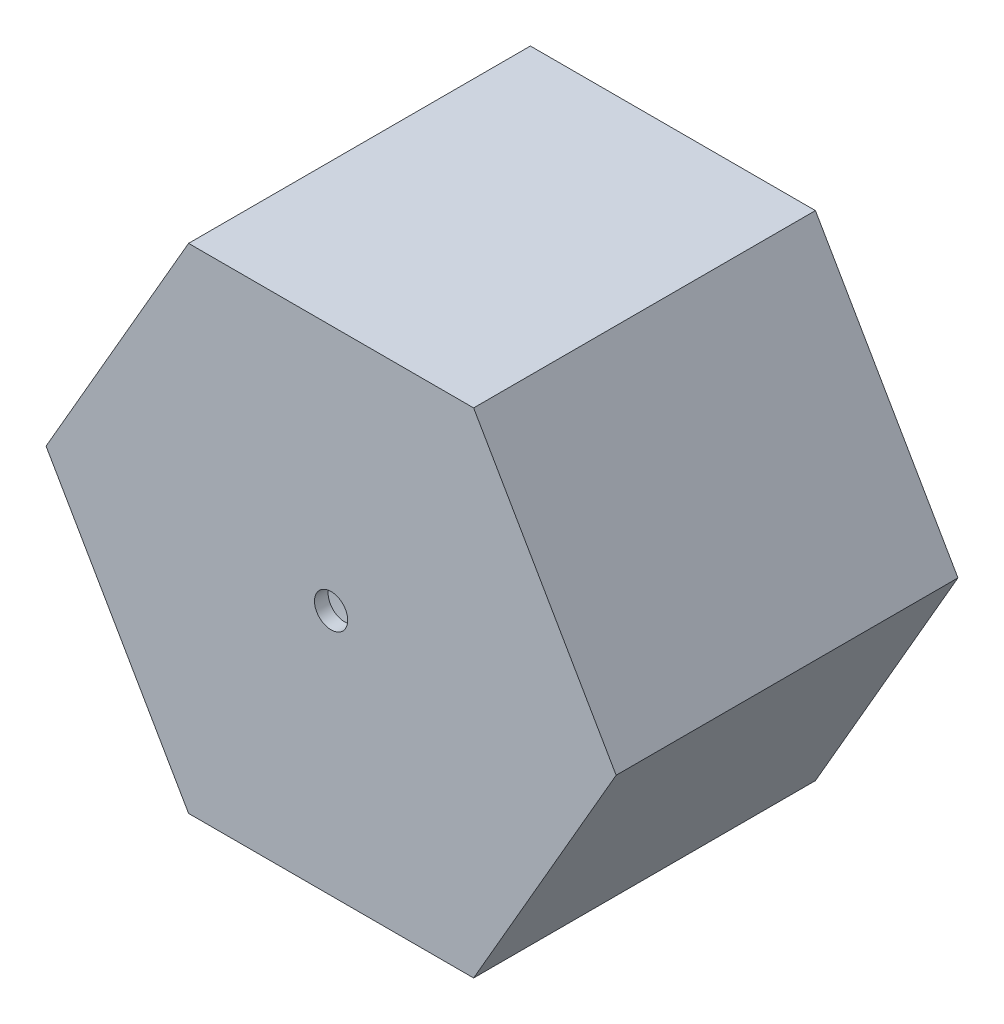
ISO-10303-21;
HEADER;
FILE_DESCRIPTION(('STEP AP214'),'2;1');
FILE_NAME('part.step','',(''),(''),'','','');
FILE_SCHEMA(('AUTOMOTIVE_DESIGN { 1 0 10303 214 1 1 1 1 }'));
ENDSEC;
DATA;
#1=APPLICATION_CONTEXT('core data for automotive mechanical design processes');
#2=APPLICATION_PROTOCOL_DEFINITION('international standard','automotive_design',2000,#1);
#3=PRODUCT_CONTEXT('',#1,'mechanical');
#4=PRODUCT('Part','Part','',(#3));
#5=PRODUCT_RELATED_PRODUCT_CATEGORY('part','',(#4));
#6=PRODUCT_DEFINITION_FORMATION('','',#4);
#7=PRODUCT_DEFINITION_CONTEXT('part definition',#1,'design');
#8=PRODUCT_DEFINITION('design','',#6,#7);
#9=PRODUCT_DEFINITION_SHAPE('','',#8);
#10=(LENGTH_UNIT() NAMED_UNIT(*) SI_UNIT(.MILLI.,.METRE.));
#11=(NAMED_UNIT(*) PLANE_ANGLE_UNIT() SI_UNIT($,.RADIAN.));
#12=(NAMED_UNIT(*) SI_UNIT($,.STERADIAN.) SOLID_ANGLE_UNIT());
#13=UNCERTAINTY_MEASURE_WITH_UNIT(LENGTH_MEASURE(1.E-05),#10,'distance_accuracy_value','');
#14=(GEOMETRIC_REPRESENTATION_CONTEXT(3) GLOBAL_UNCERTAINTY_ASSIGNED_CONTEXT((#13)) GLOBAL_UNIT_ASSIGNED_CONTEXT((#10,
#11,#12)) REPRESENTATION_CONTEXT('',''));
#15=CARTESIAN_POINT('',(0.,0.,0.));
#16=DIRECTION('',(0.,0.,1.));
#17=DIRECTION('',(1.,0.,0.));
#18=AXIS2_PLACEMENT_3D('',#15,#16,#17);
#19=CARTESIAN_POINT('',(7.50555349946513,-13.,18.));
#20=DIRECTION('',(-0.866025403784439,0.5,0.));
#21=DIRECTION('',(-0.5,-0.866025403784439,0.));
#22=AXIS2_PLACEMENT_3D('',#19,#20,#21);
#23=PLANE('',#22);
#24=DIRECTION('',(0.5,0.866025403784439,0.));
#25=VECTOR('',#24,1.);
#26=CARTESIAN_POINT('',(7.50555349946513,-13.,0.));
#27=LINE('',#26,#25);
#28=CARTESIAN_POINT('',(7.50555349946513,-13.,0.));
#29=VERTEX_POINT('',#28);
#30=CARTESIAN_POINT('',(15.0111069989303,0.,0.));
#31=VERTEX_POINT('',#30);
#32=EDGE_CURVE('E117',#29,#31,#27,.T.);
#33=ORIENTED_EDGE('',*,*,#32,.T.);
#34=DIRECTION('',(0.,0.,-1.));
#35=VECTOR('',#34,1.);
#36=CARTESIAN_POINT('',(15.0111069989303,0.,18.));
#37=LINE('',#36,#35);
#38=CARTESIAN_POINT('',(15.0111069989303,0.,18.));
#39=VERTEX_POINT('',#38);
#40=EDGE_CURVE('E11',#39,#31,#37,.T.);
#41=ORIENTED_EDGE('',*,*,#40,.F.);
#42=DIRECTION('',(0.5,0.866025403784439,0.));
#43=VECTOR('',#42,1.);
#44=CARTESIAN_POINT('',(7.50555349946513,-13.,18.));
#45=LINE('',#44,#43);
#46=CARTESIAN_POINT('',(7.50555349946513,-13.,18.));
#47=VERTEX_POINT('',#46);
#48=EDGE_CURVE('E128',#47,#39,#45,.T.);
#49=ORIENTED_EDGE('',*,*,#48,.F.);
#50=DIRECTION('',(0.,0.,-1.));
#51=VECTOR('',#50,1.);
#52=CARTESIAN_POINT('',(7.50555349946513,-13.,18.));
#53=LINE('',#52,#51);
#54=EDGE_CURVE('E113',#47,#29,#53,.T.);
#55=ORIENTED_EDGE('',*,*,#54,.T.);
#56=EDGE_LOOP('',(#33,#41,#49,#55));
#57=FACE_BOUND('',#56,.T.);
#58=ADVANCED_FACE('F32',(#57),#23,.F.);
#59=CARTESIAN_POINT('',(15.0111069989303,0.,18.));
#60=DIRECTION('',(-0.866025403784439,-0.5,0.));
#61=DIRECTION('',(0.5,-0.866025403784439,0.));
#62=AXIS2_PLACEMENT_3D('',#59,#60,#61);
#63=PLANE('',#62);
#64=DIRECTION('',(-0.5,0.866025403784439,0.));
#65=VECTOR('',#64,1.);
#66=CARTESIAN_POINT('',(15.0111069989303,0.,0.));
#67=LINE('',#66,#65);
#68=CARTESIAN_POINT('',(7.50555349946513,13.,0.));
#69=VERTEX_POINT('',#68);
#70=EDGE_CURVE('E120',#31,#69,#67,.T.);
#71=ORIENTED_EDGE('',*,*,#70,.T.);
#72=DIRECTION('',(0.,0.,-1.));
#73=VECTOR('',#72,1.);
#74=CARTESIAN_POINT('',(7.50555349946513,13.,18.));
#75=LINE('',#74,#73);
#76=CARTESIAN_POINT('',(7.50555349946513,13.,18.));
#77=VERTEX_POINT('',#76);
#78=EDGE_CURVE('E41',#77,#69,#75,.T.);
#79=ORIENTED_EDGE('',*,*,#78,.F.);
#80=DIRECTION('',(-0.5,0.866025403784439,0.));
#81=VECTOR('',#80,1.);
#82=CARTESIAN_POINT('',(15.0111069989303,0.,18.));
#83=LINE('',#82,#81);
#84=EDGE_CURVE('E86',#39,#77,#83,.T.);
#85=ORIENTED_EDGE('',*,*,#84,.F.);
#86=ORIENTED_EDGE('',*,*,#40,.T.);
#87=EDGE_LOOP('',(#71,#79,#85,#86));
#88=FACE_BOUND('',#87,.T.);
#89=ADVANCED_FACE('F154',(#88),#63,.F.);
#90=CARTESIAN_POINT('',(7.50555349946513,13.,18.));
#91=DIRECTION('',(0.,-1.,0.));
#92=DIRECTION('',(1.,0.,0.));
#93=AXIS2_PLACEMENT_3D('',#90,#91,#92);
#94=PLANE('',#93);
#95=DIRECTION('',(-1.,0.,0.));
#96=VECTOR('',#95,1.);
#97=CARTESIAN_POINT('',(7.50555349946513,13.,0.));
#98=LINE('',#97,#96);
#99=CARTESIAN_POINT('',(-7.50555349946514,13.,0.));
#100=VERTEX_POINT('',#99);
#101=EDGE_CURVE('E123',#69,#100,#98,.T.);
#102=ORIENTED_EDGE('',*,*,#101,.T.);
#103=DIRECTION('',(0.,0.,-1.));
#104=VECTOR('',#103,1.);
#105=CARTESIAN_POINT('',(-7.50555349946514,13.,18.));
#106=LINE('',#105,#104);
#107=CARTESIAN_POINT('',(-7.50555349946514,13.,18.));
#108=VERTEX_POINT('',#107);
#109=EDGE_CURVE('E108',#108,#100,#106,.T.);
#110=ORIENTED_EDGE('',*,*,#109,.F.);
#111=DIRECTION('',(-1.,0.,0.));
#112=VECTOR('',#111,1.);
#113=CARTESIAN_POINT('',(7.50555349946513,13.,18.));
#114=LINE('',#113,#112);
#115=EDGE_CURVE('E99',#77,#108,#114,.T.);
#116=ORIENTED_EDGE('',*,*,#115,.F.);
#117=ORIENTED_EDGE('',*,*,#78,.T.);
#118=EDGE_LOOP('',(#102,#110,#116,#117));
#119=FACE_BOUND('',#118,.T.);
#120=ADVANCED_FACE('F135',(#119),#94,.F.);
#121=CARTESIAN_POINT('',(-7.50555349946514,13.,18.));
#122=DIRECTION('',(0.866025403784439,-0.5,0.));
#123=DIRECTION('',(0.5,0.866025403784439,0.));
#124=AXIS2_PLACEMENT_3D('',#121,#122,#123);
#125=PLANE('',#124);
#126=DIRECTION('',(-0.5,-0.866025403784439,0.));
#127=VECTOR('',#126,1.);
#128=CARTESIAN_POINT('',(-7.50555349946514,13.,0.));
#129=LINE('',#128,#127);
#130=CARTESIAN_POINT('',(-15.0111069989303,0.,0.));
#131=VERTEX_POINT('',#130);
#132=EDGE_CURVE('E107',#100,#131,#129,.T.);
#133=ORIENTED_EDGE('',*,*,#132,.T.);
#134=DIRECTION('',(0.,0.,-1.));
#135=VECTOR('',#134,1.);
#136=CARTESIAN_POINT('',(-15.0111069989303,0.,18.));
#137=LINE('',#136,#135);
#138=CARTESIAN_POINT('',(-15.0111069989303,0.,18.));
#139=VERTEX_POINT('',#138);
#140=EDGE_CURVE('E104',#139,#131,#137,.T.);
#141=ORIENTED_EDGE('',*,*,#140,.F.);
#142=DIRECTION('',(-0.5,-0.866025403784439,0.));
#143=VECTOR('',#142,1.);
#144=CARTESIAN_POINT('',(-7.50555349946514,13.,18.));
#145=LINE('',#144,#143);
#146=EDGE_CURVE('E93',#108,#139,#145,.T.);
#147=ORIENTED_EDGE('',*,*,#146,.F.);
#148=ORIENTED_EDGE('',*,*,#109,.T.);
#149=EDGE_LOOP('',(#133,#141,#147,#148));
#150=FACE_BOUND('',#149,.T.);
#151=ADVANCED_FACE('F105',(#150),#125,.F.);
#152=CARTESIAN_POINT('',(-15.0111069989303,0.,18.));
#153=DIRECTION('',(0.866025403784439,0.5,0.));
#154=DIRECTION('',(-0.5,0.866025403784439,0.));
#155=AXIS2_PLACEMENT_3D('',#152,#153,#154);
#156=PLANE('',#155);
#157=DIRECTION('',(0.5,-0.866025403784439,0.));
#158=VECTOR('',#157,1.);
#159=CARTESIAN_POINT('',(-15.0111069989303,0.,0.));
#160=LINE('',#159,#158);
#161=CARTESIAN_POINT('',(-7.50555349946514,-13.,0.));
#162=VERTEX_POINT('',#161);
#163=EDGE_CURVE('E72',#131,#162,#160,.T.);
#164=ORIENTED_EDGE('',*,*,#163,.T.);
#165=DIRECTION('',(0.,0.,-1.));
#166=VECTOR('',#165,1.);
#167=CARTESIAN_POINT('',(-7.50555349946514,-13.,18.));
#168=LINE('',#167,#166);
#169=CARTESIAN_POINT('',(-7.50555349946514,-13.,18.));
#170=VERTEX_POINT('',#169);
#171=EDGE_CURVE('E109',#170,#162,#168,.T.);
#172=ORIENTED_EDGE('',*,*,#171,.F.);
#173=DIRECTION('',(0.5,-0.866025403784439,0.));
#174=VECTOR('',#173,1.);
#175=CARTESIAN_POINT('',(-15.0111069989303,0.,18.));
#176=LINE('',#175,#174);
#177=EDGE_CURVE('E97',#139,#170,#176,.T.);
#178=ORIENTED_EDGE('',*,*,#177,.F.);
#179=ORIENTED_EDGE('',*,*,#140,.T.);
#180=EDGE_LOOP('',(#164,#172,#178,#179));
#181=FACE_BOUND('',#180,.T.);
#182=ADVANCED_FACE('F111',(#181),#156,.F.);
#183=CARTESIAN_POINT('',(-7.50555349946514,-13.,18.));
#184=DIRECTION('',(0.,1.,0.));
#185=DIRECTION('',(0.,0.,1.));
#186=AXIS2_PLACEMENT_3D('',#183,#184,#185);
#187=PLANE('',#186);
#188=DIRECTION('',(1.,0.,0.));
#189=VECTOR('',#188,1.);
#190=CARTESIAN_POINT('',(-7.50555349946514,-13.,0.));
#191=LINE('',#190,#189);
#192=EDGE_CURVE('E78',#162,#29,#191,.T.);
#193=ORIENTED_EDGE('',*,*,#192,.T.);
#194=ORIENTED_EDGE('',*,*,#54,.F.);
#195=DIRECTION('',(1.,0.,0.));
#196=VECTOR('',#195,1.);
#197=CARTESIAN_POINT('',(-7.50555349946514,-13.,18.));
#198=LINE('',#197,#196);
#199=EDGE_CURVE('E49',#170,#47,#198,.T.);
#200=ORIENTED_EDGE('',*,*,#199,.F.);
#201=ORIENTED_EDGE('',*,*,#171,.T.);
#202=EDGE_LOOP('',(#193,#194,#200,#201));
#203=FACE_BOUND('',#202,.T.);
#204=ADVANCED_FACE('F142',(#203),#187,.F.);
#205=CARTESIAN_POINT('',(0.,0.,18.));
#206=DIRECTION('',(0.,0.,1.));
#207=DIRECTION('',(1.,0.,0.));
#208=AXIS2_PLACEMENT_3D('',#205,#206,#207);
#209=PLANE('',#208);
#210=CARTESIAN_POINT('',(0.,0.,18.));
#211=DIRECTION('',(0.,0.,1.));
#212=DIRECTION('',(1.,0.,0.));
#213=AXIS2_PLACEMENT_3D('',#210,#211,#212);
#214=CIRCLE('',#213,0.874999999999987);
#215=CARTESIAN_POINT('',(0.874999999999987,0.,18.));
#216=VERTEX_POINT('',#215);
#217=EDGE_CURVE('E227',#216,#216,#214,.T.);
#218=ORIENTED_EDGE('',*,*,#217,.F.);
#219=EDGE_LOOP('',(#218));
#220=FACE_BOUND('',#219,.T.);
#221=ORIENTED_EDGE('',*,*,#48,.T.);
#222=ORIENTED_EDGE('',*,*,#84,.T.);
#223=ORIENTED_EDGE('',*,*,#115,.T.);
#224=ORIENTED_EDGE('',*,*,#146,.T.);
#225=ORIENTED_EDGE('',*,*,#177,.T.);
#226=ORIENTED_EDGE('',*,*,#199,.T.);
#227=EDGE_LOOP('',(#221,#222,#223,#224,#225,#226));
#228=FACE_BOUND('',#227,.T.);
#229=ADVANCED_FACE('F95',(#220,#228),#209,.T.);
#230=CARTESIAN_POINT('',(0.,0.,0.));
#231=DIRECTION('',(0.,0.,1.));
#232=DIRECTION('',(1.,0.,0.));
#233=AXIS2_PLACEMENT_3D('',#230,#231,#232);
#234=PLANE('',#233);
#235=CARTESIAN_POINT('',(0.,0.,0.));
#236=DIRECTION('',(0.,0.,-1.));
#237=DIRECTION('',(-1.,0.,0.));
#238=AXIS2_PLACEMENT_3D('',#235,#236,#237);
#239=CIRCLE('',#238,7.99999999999999);
#240=CARTESIAN_POINT('',(-7.99999999999999,0.,0.));
#241=VERTEX_POINT('',#240);
#242=EDGE_CURVE('E230',#241,#241,#239,.T.);
#243=ORIENTED_EDGE('',*,*,#242,.F.);
#244=EDGE_LOOP('',(#243));
#245=FACE_BOUND('',#244,.T.);
#246=ORIENTED_EDGE('',*,*,#32,.F.);
#247=ORIENTED_EDGE('',*,*,#192,.F.);
#248=ORIENTED_EDGE('',*,*,#163,.F.);
#249=ORIENTED_EDGE('',*,*,#132,.F.);
#250=ORIENTED_EDGE('',*,*,#101,.F.);
#251=ORIENTED_EDGE('',*,*,#70,.F.);
#252=EDGE_LOOP('',(#246,#247,#248,#249,#250,#251));
#253=FACE_BOUND('',#252,.T.);
#254=ADVANCED_FACE('F138',(#245,#253),#234,.F.);
#255=CARTESIAN_POINT('',(0.,0.,13.));
#256=DIRECTION('',(0.,0.,-1.));
#257=DIRECTION('',(-1.,0.,0.));
#258=AXIS2_PLACEMENT_3D('',#255,#256,#257);
#259=CONICAL_SURFACE('',#258,8.,1.02974425867665);
#260=CARTESIAN_POINT('',(0.,0.,17.2811319105714));
#261=DIRECTION('',(0.,0.,-1.));
#262=DIRECTION('',(-1.,0.,0.));
#263=AXIS2_PLACEMENT_3D('',#260,#261,#262);
#264=CIRCLE('',#263,0.874999999999991);
#265=CARTESIAN_POINT('',(-0.874999999999991,0.,17.2811319105714));
#266=VERTEX_POINT('',#265);
#267=EDGE_CURVE('E35',#266,#266,#264,.F.);
#268=ORIENTED_EDGE('',*,*,#267,.T.);
#269=EDGE_LOOP('',(#268));
#270=FACE_BOUND('',#269,.T.);
#271=CARTESIAN_POINT('',(0.,0.,13.));
#272=DIRECTION('',(0.,0.,-1.));
#273=DIRECTION('',(-1.,0.,0.));
#274=AXIS2_PLACEMENT_3D('',#271,#272,#273);
#275=CIRCLE('',#274,8.);
#276=CARTESIAN_POINT('',(-8.,0.,13.));
#277=VERTEX_POINT('',#276);
#278=EDGE_CURVE('E121',#277,#277,#275,.T.);
#279=ORIENTED_EDGE('',*,*,#278,.T.);
#280=EDGE_LOOP('',(#279));
#281=FACE_BOUND('',#280,.T.);
#282=ADVANCED_FACE('F186',(#270,#281),#259,.F.);
#283=CARTESIAN_POINT('',(0.,0.,0.));
#284=DIRECTION('',(0.,0.,-1.));
#285=DIRECTION('',(-1.,0.,0.));
#286=AXIS2_PLACEMENT_3D('',#283,#284,#285);
#287=CYLINDRICAL_SURFACE('',#286,7.99999999999999);
#288=ORIENTED_EDGE('',*,*,#278,.F.);
#289=EDGE_LOOP('',(#288));
#290=FACE_BOUND('',#289,.T.);
#291=ORIENTED_EDGE('',*,*,#242,.T.);
#292=EDGE_LOOP('',(#291));
#293=FACE_BOUND('',#292,.T.);
#294=ADVANCED_FACE('F193',(#290,#293),#287,.F.);
#295=CARTESIAN_POINT('',(0.,0.,18.));
#296=DIRECTION('',(0.,0.,1.));
#297=DIRECTION('',(1.,0.,0.));
#298=AXIS2_PLACEMENT_3D('',#295,#296,#297);
#299=CYLINDRICAL_SURFACE('',#298,0.874999999999991);
#300=ORIENTED_EDGE('',*,*,#217,.T.);
#301=EDGE_LOOP('',(#300));
#302=FACE_BOUND('',#301,.T.);
#303=ORIENTED_EDGE('',*,*,#267,.F.);
#304=EDGE_LOOP('',(#303));
#305=FACE_BOUND('',#304,.T.);
#306=ADVANCED_FACE('F198',(#302,#305),#299,.F.);
#307=CLOSED_SHELL('',(#58,#89,#120,#151,#182,#204,#229,#254,#282,#294,#306));
#308=MANIFOLD_SOLID_BREP('B2',#307);
#309=ADVANCED_BREP_SHAPE_REPRESENTATION('',(#18,#308),#14);
#310=SHAPE_DEFINITION_REPRESENTATION(#9,#309);
ENDSEC;
END-ISO-10303-21;
